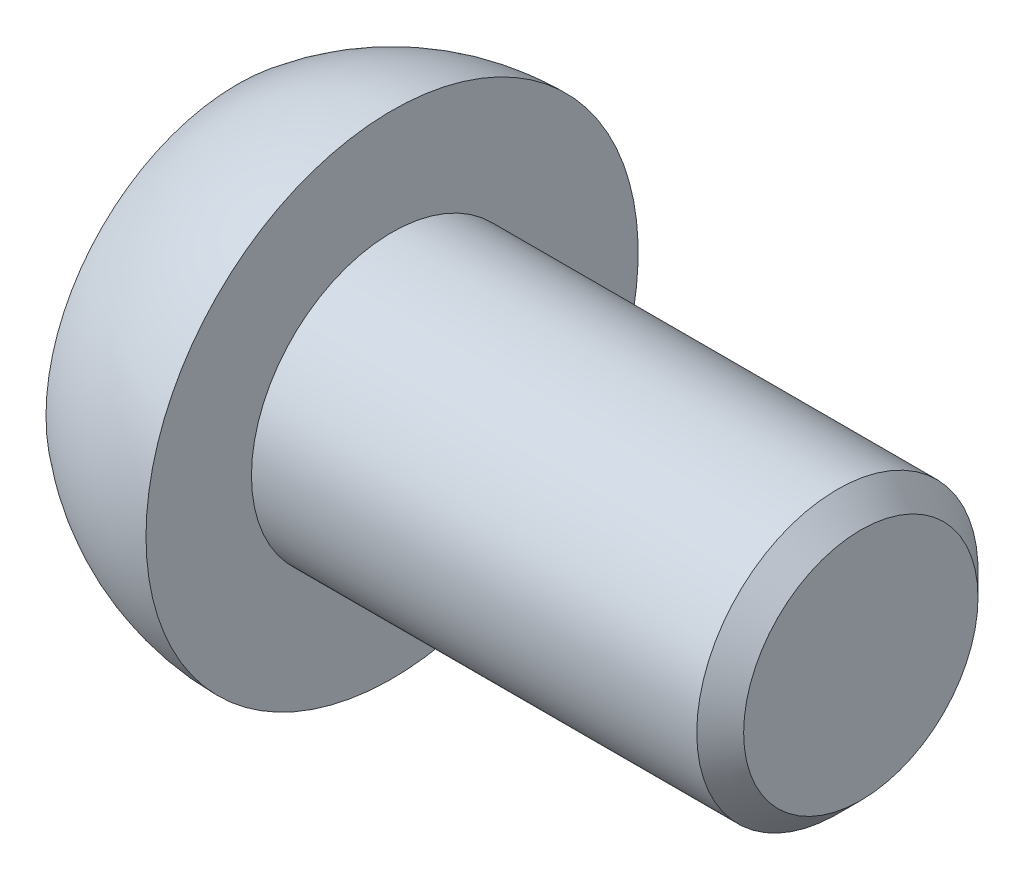
ISO-10303-21;
HEADER;
FILE_DESCRIPTION(('STEP AP214'),'2;1');
FILE_NAME('part.step','',(''),(''),'','','');
FILE_SCHEMA(('AUTOMOTIVE_DESIGN { 1 0 10303 214 1 1 1 1 }'));
ENDSEC;
DATA;
#1=APPLICATION_CONTEXT('core data for automotive mechanical design processes');
#2=APPLICATION_PROTOCOL_DEFINITION('international standard','automotive_design',2000,#1);
#3=PRODUCT_CONTEXT('',#1,'mechanical');
#4=PRODUCT('Part','Part','',(#3));
#5=PRODUCT_RELATED_PRODUCT_CATEGORY('part','',(#4));
#6=PRODUCT_DEFINITION_FORMATION('','',#4);
#7=PRODUCT_DEFINITION_CONTEXT('part definition',#1,'design');
#8=PRODUCT_DEFINITION('design','',#6,#7);
#9=PRODUCT_DEFINITION_SHAPE('','',#8);
#10=(LENGTH_UNIT() NAMED_UNIT(*) SI_UNIT(.MILLI.,.METRE.));
#11=(NAMED_UNIT(*) PLANE_ANGLE_UNIT() SI_UNIT($,.RADIAN.));
#12=(NAMED_UNIT(*) SI_UNIT($,.STERADIAN.) SOLID_ANGLE_UNIT());
#13=UNCERTAINTY_MEASURE_WITH_UNIT(LENGTH_MEASURE(1.E-05),#10,'distance_accuracy_value','');
#14=(GEOMETRIC_REPRESENTATION_CONTEXT(3) GLOBAL_UNCERTAINTY_ASSIGNED_CONTEXT((#13)) GLOBAL_UNIT_ASSIGNED_CONTEXT((#10,
#11,#12)) REPRESENTATION_CONTEXT('',''));
#15=CARTESIAN_POINT('',(0.,0.,0.));
#16=DIRECTION('',(0.,0.,1.));
#17=DIRECTION('',(1.,0.,0.));
#18=AXIS2_PLACEMENT_3D('',#15,#16,#17);
#19=CARTESIAN_POINT('',(0.,0.,0.));
#20=DIRECTION('',(-1.,0.,0.));
#21=DIRECTION('',(0.,1.,0.));
#22=AXIS2_PLACEMENT_3D('',#19,#20,#21);
#23=SPHERICAL_SURFACE('',#22,5.25);
#24=CARTESIAN_POINT('',(-3.3,0.,0.));
#25=DIRECTION('',(-1.,0.,0.));
#26=DIRECTION('',(0.,0.,1.));
#27=AXIS2_PLACEMENT_3D('',#24,#25,#26);
#28=CIRCLE('',#27,4.08319727664486);
#29=CARTESIAN_POINT('',(-3.3,0.,4.08319727664486));
#30=VERTEX_POINT('',#29);
#31=EDGE_CURVE('E162',#30,#30,#28,.T.);
#32=ORIENTED_EDGE('',*,*,#31,.F.);
#33=EDGE_LOOP('',(#32));
#34=FACE_BOUND('',#33,.T.);
#35=CARTESIAN_POINT('',(0.,0.,0.));
#36=DIRECTION('',(-1.,0.,0.));
#37=DIRECTION('',(0.,0.,1.));
#38=AXIS2_PLACEMENT_3D('',#35,#36,#37);
#39=CIRCLE('',#38,5.25);
#40=CARTESIAN_POINT('',(0.,0.,5.25));
#41=VERTEX_POINT('',#40);
#42=EDGE_CURVE('E149',#41,#41,#39,.T.);
#43=ORIENTED_EDGE('',*,*,#42,.T.);
#44=EDGE_LOOP('',(#43));
#45=FACE_BOUND('',#44,.T.);
#46=ADVANCED_FACE('F36',(#34,#45),#23,.T.);
#47=CARTESIAN_POINT('',(-3.3,0.,0.));
#48=DIRECTION('',(1.,0.,0.));
#49=DIRECTION('',(0.,0.,-1.));
#50=AXIS2_PLACEMENT_3D('',#47,#48,#49);
#51=PLANE('',#50);
#52=DIRECTION('',(0.,0.5,0.866025403784439));
#53=VECTOR('',#52,1.);
#54=CARTESIAN_POINT('',(-3.3,-1.94855715851499,1.125));
#55=LINE('',#54,#53);
#56=CARTESIAN_POINT('',(-3.3,-1.29903810567666,2.25));
#57=VERTEX_POINT('',#56);
#58=CARTESIAN_POINT('',(-3.3,-2.59807621135332,0.));
#59=VERTEX_POINT('',#58);
#60=EDGE_CURVE('E174',#57,#59,#55,.F.);
#61=ORIENTED_EDGE('',*,*,#60,.T.);
#62=DIRECTION('',(0.,-0.5,0.866025403784439));
#63=VECTOR('',#62,1.);
#64=CARTESIAN_POINT('',(-3.3,-1.94855715851499,-1.125));
#65=LINE('',#64,#63);
#66=CARTESIAN_POINT('',(-3.3,-1.29903810567666,-2.25));
#67=VERTEX_POINT('',#66);
#68=EDGE_CURVE('E176',#59,#67,#65,.F.);
#69=ORIENTED_EDGE('',*,*,#68,.T.);
#70=DIRECTION('',(0.,-1.,0.));
#71=VECTOR('',#70,1.);
#72=CARTESIAN_POINT('',(-3.3,0.,-2.25));
#73=LINE('',#72,#71);
#74=CARTESIAN_POINT('',(-3.3,1.29903810567666,-2.25));
#75=VERTEX_POINT('',#74);
#76=EDGE_CURVE('E166',#67,#75,#73,.F.);
#77=ORIENTED_EDGE('',*,*,#76,.T.);
#78=DIRECTION('',(0.,-0.5,-0.866025403784439));
#79=VECTOR('',#78,1.);
#80=CARTESIAN_POINT('',(-3.3,1.94855715851499,-1.125));
#81=LINE('',#80,#79);
#82=CARTESIAN_POINT('',(-3.3,2.59807621135332,0.));
#83=VERTEX_POINT('',#82);
#84=EDGE_CURVE('E168',#75,#83,#81,.F.);
#85=ORIENTED_EDGE('',*,*,#84,.T.);
#86=DIRECTION('',(0.,0.5,-0.866025403784439));
#87=VECTOR('',#86,1.);
#88=CARTESIAN_POINT('',(-3.3,1.94855715851499,1.125));
#89=LINE('',#88,#87);
#90=CARTESIAN_POINT('',(-3.3,1.29903810567666,2.25));
#91=VERTEX_POINT('',#90);
#92=EDGE_CURVE('E170',#83,#91,#89,.F.);
#93=ORIENTED_EDGE('',*,*,#92,.T.);
#94=DIRECTION('',(0.,1.,0.));
#95=VECTOR('',#94,1.);
#96=CARTESIAN_POINT('',(-3.3,0.,2.25));
#97=LINE('',#96,#95);
#98=EDGE_CURVE('E172',#91,#57,#97,.F.);
#99=ORIENTED_EDGE('',*,*,#98,.T.);
#100=EDGE_LOOP('',(#61,#69,#77,#85,#93,#99));
#101=FACE_BOUND('',#100,.T.);
#102=ORIENTED_EDGE('',*,*,#31,.T.);
#103=EDGE_LOOP('',(#102));
#104=FACE_BOUND('',#103,.T.);
#105=ADVANCED_FACE('F215',(#101,#104),#51,.F.);
#106=CARTESIAN_POINT('',(10.,3.,0.));
#107=DIRECTION('',(-1.,0.,0.));
#108=DIRECTION('',(0.,0.,1.));
#109=AXIS2_PLACEMENT_3D('',#106,#107,#108);
#110=PLANE('',#109);
#111=CARTESIAN_POINT('',(10.,0.,0.));
#112=DIRECTION('',(-1.,0.,0.));
#113=DIRECTION('',(0.,0.,1.));
#114=AXIS2_PLACEMENT_3D('',#111,#112,#113);
#115=CIRCLE('',#114,2.50000000000003);
#116=CARTESIAN_POINT('',(10.,0.,2.50000000000003));
#117=VERTEX_POINT('',#116);
#118=EDGE_CURVE('E11',#117,#117,#115,.F.);
#119=ORIENTED_EDGE('',*,*,#118,.T.);
#120=EDGE_LOOP('',(#119));
#121=FACE_BOUND('',#120,.T.);
#122=ADVANCED_FACE('F221',(#121),#110,.F.);
#123=CARTESIAN_POINT('',(-165.749374513975,0.,0.));
#124=DIRECTION('',(-1.,0.,0.));
#125=DIRECTION('',(0.,0.,1.));
#126=AXIS2_PLACEMENT_3D('',#123,#124,#125);
#127=CYLINDRICAL_SURFACE('',#126,3.);
#128=CARTESIAN_POINT('',(9.50000000000001,0.,0.));
#129=DIRECTION('',(-1.,0.,0.));
#130=DIRECTION('',(0.,0.,1.));
#131=AXIS2_PLACEMENT_3D('',#128,#129,#130);
#132=CIRCLE('',#131,3.);
#133=CARTESIAN_POINT('',(9.50000000000001,0.,3.));
#134=VERTEX_POINT('',#133);
#135=EDGE_CURVE('E44',#134,#134,#132,.T.);
#136=ORIENTED_EDGE('',*,*,#135,.T.);
#137=EDGE_LOOP('',(#136));
#138=FACE_BOUND('',#137,.T.);
#139=CARTESIAN_POINT('',(0.,0.,0.));
#140=DIRECTION('',(-1.,0.,0.));
#141=DIRECTION('',(0.,0.,1.));
#142=AXIS2_PLACEMENT_3D('',#139,#140,#141);
#143=CIRCLE('',#142,3.);
#144=CARTESIAN_POINT('',(0.,0.,3.));
#145=VERTEX_POINT('',#144);
#146=EDGE_CURVE('E159',#145,#145,#143,.T.);
#147=ORIENTED_EDGE('',*,*,#146,.F.);
#148=EDGE_LOOP('',(#147));
#149=FACE_BOUND('',#148,.T.);
#150=ADVANCED_FACE('F201',(#138,#149),#127,.T.);
#151=CARTESIAN_POINT('',(0.,5.25,0.));
#152=DIRECTION('',(-1.,0.,0.));
#153=DIRECTION('',(0.,0.,1.));
#154=AXIS2_PLACEMENT_3D('',#151,#152,#153);
#155=PLANE('',#154);
#156=ORIENTED_EDGE('',*,*,#42,.F.);
#157=EDGE_LOOP('',(#156));
#158=FACE_BOUND('',#157,.T.);
#159=ORIENTED_EDGE('',*,*,#146,.T.);
#160=EDGE_LOOP('',(#159));
#161=FACE_BOUND('',#160,.T.);
#162=ADVANCED_FACE('F285',(#158,#161),#155,.F.);
#163=CARTESIAN_POINT('',(-0.299999999999999,-1.15470053837925,-2.));
#164=DIRECTION('',(0.,-0.866025403784439,-0.5));
#165=DIRECTION('',(0.,0.5,-0.866025403784439));
#166=AXIS2_PLACEMENT_3D('',#163,#164,#165);
#167=PLANE('',#166);
#168=DIRECTION('',(-1.,0.,0.));
#169=VECTOR('',#168,1.);
#170=CARTESIAN_POINT('',(-0.299999999999999,-1.15470053837925,-2.));
#171=LINE('',#170,#169);
#172=CARTESIAN_POINT('',(-0.299999999999999,-1.15470053837925,-2.));
#173=VERTEX_POINT('',#172);
#174=CARTESIAN_POINT('',(-3.05,-1.15470053837925,-2.));
#175=VERTEX_POINT('',#174);
#176=EDGE_CURVE('E147',#173,#175,#171,.T.);
#177=ORIENTED_EDGE('',*,*,#176,.T.);
#178=DIRECTION('',(0.,-0.5,0.866025403784439));
#179=VECTOR('',#178,1.);
#180=CARTESIAN_POINT('',(-3.05,-1.15470053837925,-2.));
#181=LINE('',#180,#179);
#182=CARTESIAN_POINT('',(-3.05,-2.3094010767585,0.));
#183=VERTEX_POINT('',#182);
#184=EDGE_CURVE('E117',#175,#183,#181,.T.);
#185=ORIENTED_EDGE('',*,*,#184,.T.);
#186=DIRECTION('',(-1.,0.,0.));
#187=VECTOR('',#186,1.);
#188=CARTESIAN_POINT('',(-0.299999999999999,-2.3094010767585,0.));
#189=LINE('',#188,#187);
#190=CARTESIAN_POINT('',(-0.299999999999999,-2.3094010767585,0.));
#191=VERTEX_POINT('',#190);
#192=EDGE_CURVE('E109',#191,#183,#189,.T.);
#193=ORIENTED_EDGE('',*,*,#192,.F.);
#194=DIRECTION('',(0.,-0.5,0.866025403784438));
#195=VECTOR('',#194,1.);
#196=CARTESIAN_POINT('',(-0.299999999999999,-1.15470053837925,-2.));
#197=LINE('',#196,#195);
#198=EDGE_CURVE('E114',#173,#191,#197,.T.);
#199=ORIENTED_EDGE('',*,*,#198,.F.);
#200=EDGE_LOOP('',(#177,#185,#193,#199));
#201=FACE_BOUND('',#200,.T.);
#202=ADVANCED_FACE('F112',(#201),#167,.F.);
#203=CARTESIAN_POINT('',(-0.299999999999999,1.15470053837925,-2.));
#204=DIRECTION('',(0.,0.,-1.));
#205=DIRECTION('',(-1.,0.,0.));
#206=AXIS2_PLACEMENT_3D('',#203,#204,#205);
#207=PLANE('',#206);
#208=DIRECTION('',(-1.,0.,0.));
#209=VECTOR('',#208,1.);
#210=CARTESIAN_POINT('',(-0.299999999999999,1.15470053837925,-2.));
#211=LINE('',#210,#209);
#212=CARTESIAN_POINT('',(-0.299999999999999,1.15470053837925,-2.));
#213=VERTEX_POINT('',#212);
#214=CARTESIAN_POINT('',(-3.05,1.15470053837925,-2.));
#215=VERTEX_POINT('',#214);
#216=EDGE_CURVE('E150',#213,#215,#211,.T.);
#217=ORIENTED_EDGE('',*,*,#216,.T.);
#218=DIRECTION('',(0.,-1.,0.));
#219=VECTOR('',#218,1.);
#220=CARTESIAN_POINT('',(-3.05,1.15470053837925,-2.));
#221=LINE('',#220,#219);
#222=EDGE_CURVE('E185',#215,#175,#221,.T.);
#223=ORIENTED_EDGE('',*,*,#222,.T.);
#224=ORIENTED_EDGE('',*,*,#176,.F.);
#225=DIRECTION('',(0.,-1.,0.));
#226=VECTOR('',#225,1.);
#227=CARTESIAN_POINT('',(-0.299999999999999,1.15470053837925,-2.));
#228=LINE('',#227,#226);
#229=EDGE_CURVE('E120',#213,#173,#228,.T.);
#230=ORIENTED_EDGE('',*,*,#229,.F.);
#231=EDGE_LOOP('',(#217,#223,#224,#230));
#232=FACE_BOUND('',#231,.T.);
#233=ADVANCED_FACE('F264',(#232),#207,.F.);
#234=CARTESIAN_POINT('',(-0.299999999999999,2.3094010767585,0.));
#235=DIRECTION('',(0.,0.866025403784438,-0.5));
#236=DIRECTION('',(0.,0.5,0.866025403784439));
#237=AXIS2_PLACEMENT_3D('',#234,#235,#236);
#238=PLANE('',#237);
#239=DIRECTION('',(-1.,0.,0.));
#240=VECTOR('',#239,1.);
#241=CARTESIAN_POINT('',(-0.299999999999999,2.3094010767585,0.));
#242=LINE('',#241,#240);
#243=CARTESIAN_POINT('',(-0.299999999999999,2.3094010767585,0.));
#244=VERTEX_POINT('',#243);
#245=CARTESIAN_POINT('',(-3.05,2.3094010767585,0.));
#246=VERTEX_POINT('',#245);
#247=EDGE_CURVE('E152',#244,#246,#242,.T.);
#248=ORIENTED_EDGE('',*,*,#247,.T.);
#249=DIRECTION('',(0.,-0.5,-0.866025403784439));
#250=VECTOR('',#249,1.);
#251=CARTESIAN_POINT('',(-3.05,2.3094010767585,0.));
#252=LINE('',#251,#250);
#253=EDGE_CURVE('E51',#246,#215,#252,.T.);
#254=ORIENTED_EDGE('',*,*,#253,.T.);
#255=ORIENTED_EDGE('',*,*,#216,.F.);
#256=DIRECTION('',(0.,-0.5,-0.866025403784439));
#257=VECTOR('',#256,1.);
#258=CARTESIAN_POINT('',(-0.299999999999999,2.3094010767585,0.));
#259=LINE('',#258,#257);
#260=EDGE_CURVE('E144',#244,#213,#259,.T.);
#261=ORIENTED_EDGE('',*,*,#260,.F.);
#262=EDGE_LOOP('',(#248,#254,#255,#261));
#263=FACE_BOUND('',#262,.T.);
#264=ADVANCED_FACE('F266',(#263),#238,.F.);
#265=CARTESIAN_POINT('',(-0.299999999999999,1.15470053837925,2.));
#266=DIRECTION('',(0.,0.866025403784439,0.5));
#267=DIRECTION('',(0.,-0.5,0.866025403784439));
#268=AXIS2_PLACEMENT_3D('',#265,#266,#267);
#269=PLANE('',#268);
#270=DIRECTION('',(-1.,0.,0.));
#271=VECTOR('',#270,1.);
#272=CARTESIAN_POINT('',(-0.299999999999999,1.15470053837925,2.));
#273=LINE('',#272,#271);
#274=CARTESIAN_POINT('',(-0.299999999999999,1.15470053837925,2.));
#275=VERTEX_POINT('',#274);
#276=CARTESIAN_POINT('',(-3.05,1.15470053837925,2.));
#277=VERTEX_POINT('',#276);
#278=EDGE_CURVE('E154',#275,#277,#273,.T.);
#279=ORIENTED_EDGE('',*,*,#278,.T.);
#280=DIRECTION('',(0.,0.5,-0.866025403784439));
#281=VECTOR('',#280,1.);
#282=CARTESIAN_POINT('',(-3.05,1.15470053837925,2.));
#283=LINE('',#282,#281);
#284=EDGE_CURVE('E59',#277,#246,#283,.T.);
#285=ORIENTED_EDGE('',*,*,#284,.T.);
#286=ORIENTED_EDGE('',*,*,#247,.F.);
#287=DIRECTION('',(0.,0.5,-0.866025403784438));
#288=VECTOR('',#287,1.);
#289=CARTESIAN_POINT('',(-0.299999999999999,1.15470053837925,2.));
#290=LINE('',#289,#288);
#291=EDGE_CURVE('E141',#275,#244,#290,.T.);
#292=ORIENTED_EDGE('',*,*,#291,.F.);
#293=EDGE_LOOP('',(#279,#285,#286,#292));
#294=FACE_BOUND('',#293,.T.);
#295=ADVANCED_FACE('F268',(#294),#269,.F.);
#296=CARTESIAN_POINT('',(-0.299999999999999,-1.15470053837925,2.));
#297=DIRECTION('',(0.,0.,1.));
#298=DIRECTION('',(1.,0.,0.));
#299=AXIS2_PLACEMENT_3D('',#296,#297,#298);
#300=PLANE('',#299);
#301=DIRECTION('',(-1.,0.,0.));
#302=VECTOR('',#301,1.);
#303=CARTESIAN_POINT('',(-0.299999999999999,-1.15470053837925,2.));
#304=LINE('',#303,#302);
#305=CARTESIAN_POINT('',(-0.299999999999999,-1.15470053837925,2.));
#306=VERTEX_POINT('',#305);
#307=CARTESIAN_POINT('',(-3.05,-1.15470053837925,2.));
#308=VERTEX_POINT('',#307);
#309=EDGE_CURVE('E119',#306,#308,#304,.T.);
#310=ORIENTED_EDGE('',*,*,#309,.T.);
#311=DIRECTION('',(0.,1.,0.));
#312=VECTOR('',#311,1.);
#313=CARTESIAN_POINT('',(-3.05,-1.15470053837925,2.));
#314=LINE('',#313,#312);
#315=EDGE_CURVE('E181',#308,#277,#314,.T.);
#316=ORIENTED_EDGE('',*,*,#315,.T.);
#317=ORIENTED_EDGE('',*,*,#278,.F.);
#318=DIRECTION('',(0.,1.,0.));
#319=VECTOR('',#318,1.);
#320=CARTESIAN_POINT('',(-0.299999999999999,-1.15470053837925,2.));
#321=LINE('',#320,#319);
#322=EDGE_CURVE('E129',#306,#275,#321,.T.);
#323=ORIENTED_EDGE('',*,*,#322,.F.);
#324=EDGE_LOOP('',(#310,#316,#317,#323));
#325=FACE_BOUND('',#324,.T.);
#326=ADVANCED_FACE('F270',(#325),#300,.F.);
#327=CARTESIAN_POINT('',(-0.299999999999999,-2.3094010767585,0.));
#328=DIRECTION('',(0.,-0.866025403784438,0.5));
#329=DIRECTION('',(0.,-0.5,-0.866025403784439));
#330=AXIS2_PLACEMENT_3D('',#327,#328,#329);
#331=PLANE('',#330);
#332=ORIENTED_EDGE('',*,*,#192,.T.);
#333=DIRECTION('',(0.,0.5,0.866025403784439));
#334=VECTOR('',#333,1.);
#335=CARTESIAN_POINT('',(-3.05,-2.3094010767585,0.));
#336=LINE('',#335,#334);
#337=EDGE_CURVE('E179',#183,#308,#336,.T.);
#338=ORIENTED_EDGE('',*,*,#337,.T.);
#339=ORIENTED_EDGE('',*,*,#309,.F.);
#340=DIRECTION('',(0.,0.5,0.866025403784439));
#341=VECTOR('',#340,1.);
#342=CARTESIAN_POINT('',(-0.299999999999999,-2.3094010767585,0.));
#343=LINE('',#342,#341);
#344=EDGE_CURVE('E123',#191,#306,#343,.T.);
#345=ORIENTED_EDGE('',*,*,#344,.F.);
#346=EDGE_LOOP('',(#332,#338,#339,#345));
#347=FACE_BOUND('',#346,.T.);
#348=ADVANCED_FACE('F124',(#347),#331,.F.);
#349=CARTESIAN_POINT('',(-0.299999999999999,0.,0.));
#350=DIRECTION('',(-1.,0.,0.));
#351=DIRECTION('',(0.,0.,1.));
#352=AXIS2_PLACEMENT_3D('',#349,#350,#351);
#353=PLANE('',#352);
#354=ORIENTED_EDGE('',*,*,#198,.T.);
#355=ORIENTED_EDGE('',*,*,#344,.T.);
#356=ORIENTED_EDGE('',*,*,#322,.T.);
#357=ORIENTED_EDGE('',*,*,#291,.T.);
#358=ORIENTED_EDGE('',*,*,#260,.T.);
#359=ORIENTED_EDGE('',*,*,#229,.T.);
#360=EDGE_LOOP('',(#354,#355,#356,#357,#358,#359));
#361=FACE_BOUND('',#360,.T.);
#362=ADVANCED_FACE('F131',(#361),#353,.T.);
#363=CARTESIAN_POINT('',(-3.05,1.37120688932536,2.125));
#364=DIRECTION('',(0.,0.5,-0.866025403784439));
#365=DIRECTION('',(0.,0.866025403784439,0.5));
#366=AXIS2_PLACEMENT_3D('',#363,#364,#365);
#367=CYLINDRICAL_SURFACE('',#366,0.25);
#368=CARTESIAN_POINT('',(-3.05,1.29903810567666,2.25));
#369=DIRECTION('',(0.,0.866025403784439,-0.5));
#370=DIRECTION('',(0.,0.5,0.866025403784439));
#371=AXIS2_PLACEMENT_3D('',#368,#369,#370);
#372=ELLIPSE('',#371,0.288675134594813,0.25);
#373=EDGE_CURVE('E137',#91,#277,#372,.F.);
#374=ORIENTED_EDGE('',*,*,#373,.F.);
#375=ORIENTED_EDGE('',*,*,#92,.F.);
#376=CARTESIAN_POINT('',(-3.05,2.59807621135332,0.));
#377=DIRECTION('',(0.,0.,-1.));
#378=DIRECTION('',(0.,1.,0.));
#379=AXIS2_PLACEMENT_3D('',#376,#377,#378);
#380=ELLIPSE('',#379,0.288675134594813,0.25);
#381=EDGE_CURVE('E134',#246,#83,#380,.T.);
#382=ORIENTED_EDGE('',*,*,#381,.F.);
#383=ORIENTED_EDGE('',*,*,#284,.F.);
#384=EDGE_LOOP('',(#374,#375,#382,#383));
#385=FACE_BOUND('',#384,.T.);
#386=ADVANCED_FACE('F241',(#385),#367,.T.);
#387=CARTESIAN_POINT('',(-3.05,2.52590742770461,-0.125));
#388=DIRECTION('',(0.,-0.5,-0.866025403784439));
#389=DIRECTION('',(0.,0.866025403784439,-0.5));
#390=AXIS2_PLACEMENT_3D('',#387,#388,#389);
#391=CYLINDRICAL_SURFACE('',#390,0.25);
#392=ORIENTED_EDGE('',*,*,#381,.T.);
#393=ORIENTED_EDGE('',*,*,#84,.F.);
#394=CARTESIAN_POINT('',(-3.05,1.29903810567666,-2.25));
#395=DIRECTION('',(0.,-0.866025403784439,-0.5));
#396=DIRECTION('',(0.,0.5,-0.866025403784439));
#397=AXIS2_PLACEMENT_3D('',#394,#395,#396);
#398=ELLIPSE('',#397,0.288675134594813,0.25);
#399=EDGE_CURVE('E194',#215,#75,#398,.T.);
#400=ORIENTED_EDGE('',*,*,#399,.F.);
#401=ORIENTED_EDGE('',*,*,#253,.F.);
#402=EDGE_LOOP('',(#392,#393,#400,#401));
#403=FACE_BOUND('',#402,.T.);
#404=ADVANCED_FACE('F238',(#403),#391,.T.);
#405=CARTESIAN_POINT('',(-3.05,-1.15470053837925,2.25));
#406=DIRECTION('',(0.,1.,0.));
#407=DIRECTION('',(0.,0.,1.));
#408=AXIS2_PLACEMENT_3D('',#405,#406,#407);
#409=CYLINDRICAL_SURFACE('',#408,0.25);
#410=ORIENTED_EDGE('',*,*,#373,.T.);
#411=ORIENTED_EDGE('',*,*,#315,.F.);
#412=CARTESIAN_POINT('',(-3.05,-1.29903810567666,2.25));
#413=DIRECTION('',(0.,0.866025403784439,0.5));
#414=DIRECTION('',(0.,-0.5,0.866025403784439));
#415=AXIS2_PLACEMENT_3D('',#412,#413,#414);
#416=ELLIPSE('',#415,0.288675134594813,0.25);
#417=EDGE_CURVE('E191',#57,#308,#416,.F.);
#418=ORIENTED_EDGE('',*,*,#417,.F.);
#419=ORIENTED_EDGE('',*,*,#98,.F.);
#420=EDGE_LOOP('',(#410,#411,#418,#419));
#421=FACE_BOUND('',#420,.T.);
#422=ADVANCED_FACE('F234',(#421),#409,.T.);
#423=CARTESIAN_POINT('',(-3.05,1.15470053837925,-2.25));
#424=DIRECTION('',(0.,-1.,0.));
#425=DIRECTION('',(0.,0.,-1.));
#426=AXIS2_PLACEMENT_3D('',#423,#424,#425);
#427=CYLINDRICAL_SURFACE('',#426,0.25);
#428=ORIENTED_EDGE('',*,*,#399,.T.);
#429=ORIENTED_EDGE('',*,*,#76,.F.);
#430=CARTESIAN_POINT('',(-3.05,-1.29903810567666,-2.25));
#431=DIRECTION('',(0.,-0.866025403784439,0.5));
#432=DIRECTION('',(0.,0.5,0.866025403784439));
#433=AXIS2_PLACEMENT_3D('',#430,#431,#432);
#434=ELLIPSE('',#433,0.288675134594813,0.25);
#435=EDGE_CURVE('E189',#175,#67,#434,.T.);
#436=ORIENTED_EDGE('',*,*,#435,.F.);
#437=ORIENTED_EDGE('',*,*,#222,.F.);
#438=EDGE_LOOP('',(#428,#429,#436,#437));
#439=FACE_BOUND('',#438,.T.);
#440=ADVANCED_FACE('F230',(#439),#427,.T.);
#441=CARTESIAN_POINT('',(-3.05,-2.52590742770461,0.125));
#442=DIRECTION('',(0.,0.5,0.866025403784439));
#443=DIRECTION('',(0.,-0.866025403784439,0.5));
#444=AXIS2_PLACEMENT_3D('',#441,#442,#443);
#445=CYLINDRICAL_SURFACE('',#444,0.25);
#446=ORIENTED_EDGE('',*,*,#417,.T.);
#447=ORIENTED_EDGE('',*,*,#337,.F.);
#448=CARTESIAN_POINT('',(-3.05,-2.59807621135332,0.));
#449=DIRECTION('',(0.,0.,1.));
#450=DIRECTION('',(0.,-1.,0.));
#451=AXIS2_PLACEMENT_3D('',#448,#449,#450);
#452=ELLIPSE('',#451,0.288675134594813,0.25);
#453=EDGE_CURVE('E187',#59,#183,#452,.F.);
#454=ORIENTED_EDGE('',*,*,#453,.F.);
#455=ORIENTED_EDGE('',*,*,#60,.F.);
#456=EDGE_LOOP('',(#446,#447,#454,#455));
#457=FACE_BOUND('',#456,.T.);
#458=ADVANCED_FACE('F210',(#457),#445,.T.);
#459=CARTESIAN_POINT('',(-3.05,-1.37120688932536,-2.125));
#460=DIRECTION('',(0.,-0.5,0.866025403784439));
#461=DIRECTION('',(0.,-0.866025403784439,-0.5));
#462=AXIS2_PLACEMENT_3D('',#459,#460,#461);
#463=CYLINDRICAL_SURFACE('',#462,0.25);
#464=ORIENTED_EDGE('',*,*,#435,.T.);
#465=ORIENTED_EDGE('',*,*,#68,.F.);
#466=ORIENTED_EDGE('',*,*,#453,.T.);
#467=ORIENTED_EDGE('',*,*,#184,.F.);
#468=EDGE_LOOP('',(#464,#465,#466,#467));
#469=FACE_BOUND('',#468,.T.);
#470=ADVANCED_FACE('F205',(#469),#463,.T.);
#471=CARTESIAN_POINT('',(9.50000000000001,0.,0.));
#472=DIRECTION('',(-1.,0.,0.));
#473=DIRECTION('',(0.,0.,1.));
#474=AXIS2_PLACEMENT_3D('',#471,#472,#473);
#475=CONICAL_SURFACE('',#474,3.,0.785398163397428);
#476=ORIENTED_EDGE('',*,*,#118,.F.);
#477=EDGE_LOOP('',(#476));
#478=FACE_BOUND('',#477,.T.);
#479=ORIENTED_EDGE('',*,*,#135,.F.);
#480=EDGE_LOOP('',(#479));
#481=FACE_BOUND('',#480,.T.);
#482=ADVANCED_FACE('F38',(#478,#481),#475,.T.);
#483=CLOSED_SHELL('',(#46,#105,#122,#150,#162,#202,#233,#264,#295,#326,#348,#362,#386,#404,#422,
#440,#458,#470,#482));
#484=MANIFOLD_SOLID_BREP('B2',#483);
#485=ADVANCED_BREP_SHAPE_REPRESENTATION('',(#18,#484),#14);
#486=SHAPE_DEFINITION_REPRESENTATION(#9,#485);
ENDSEC;
END-ISO-10303-21;
